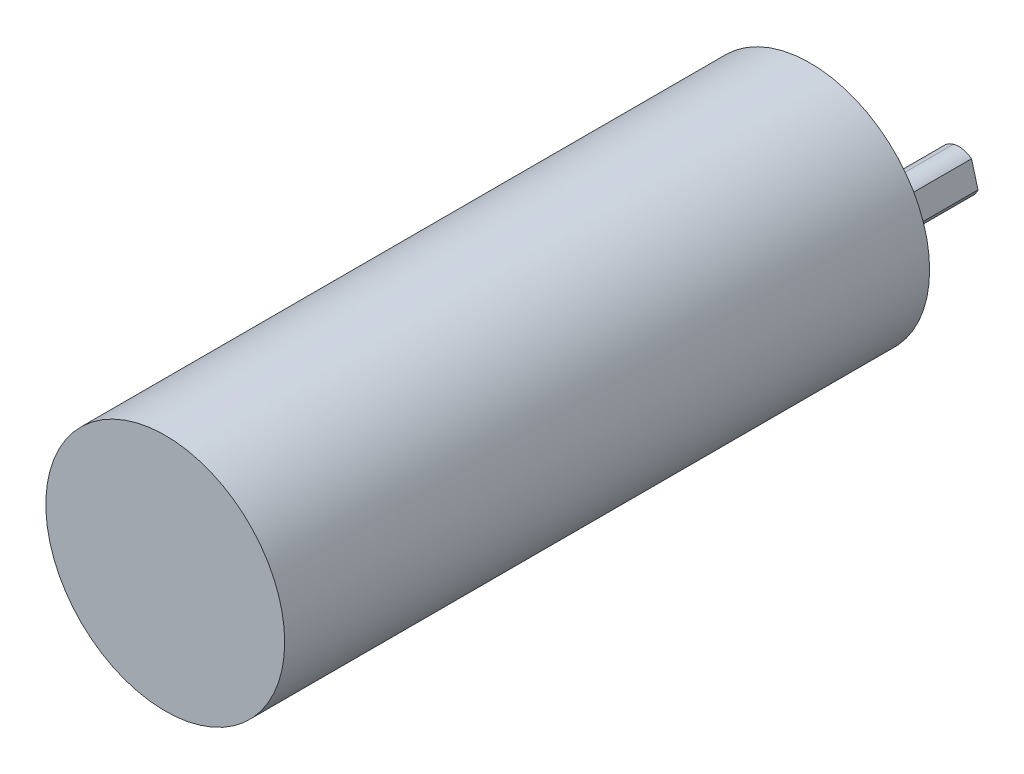
ISO-10303-21;
HEADER;
FILE_DESCRIPTION(('STEP AP214'),'2;1');
FILE_NAME('part.step','',(''),(''),'','','');
FILE_SCHEMA(('AUTOMOTIVE_DESIGN { 1 0 10303 214 1 1 1 1 }'));
ENDSEC;
DATA;
#1=APPLICATION_CONTEXT('core data for automotive mechanical design processes');
#2=APPLICATION_PROTOCOL_DEFINITION('international standard','automotive_design',2000,#1);
#3=PRODUCT_CONTEXT('',#1,'mechanical');
#4=PRODUCT('Part','Part','',(#3));
#5=PRODUCT_RELATED_PRODUCT_CATEGORY('part','',(#4));
#6=PRODUCT_DEFINITION_FORMATION('','',#4);
#7=PRODUCT_DEFINITION_CONTEXT('part definition',#1,'design');
#8=PRODUCT_DEFINITION('design','',#6,#7);
#9=PRODUCT_DEFINITION_SHAPE('','',#8);
#10=(LENGTH_UNIT() NAMED_UNIT(*) SI_UNIT(.MILLI.,.METRE.));
#11=(NAMED_UNIT(*) PLANE_ANGLE_UNIT() SI_UNIT($,.RADIAN.));
#12=(NAMED_UNIT(*) SI_UNIT($,.STERADIAN.) SOLID_ANGLE_UNIT());
#13=UNCERTAINTY_MEASURE_WITH_UNIT(LENGTH_MEASURE(1.E-05),#10,'distance_accuracy_value','');
#14=(GEOMETRIC_REPRESENTATION_CONTEXT(3) GLOBAL_UNCERTAINTY_ASSIGNED_CONTEXT((#13)) GLOBAL_UNIT_ASSIGNED_CONTEXT((#10,
#11,#12)) REPRESENTATION_CONTEXT('',''));
#15=CARTESIAN_POINT('',(0.,0.,0.));
#16=DIRECTION('',(0.,0.,1.));
#17=DIRECTION('',(1.,0.,0.));
#18=AXIS2_PLACEMENT_3D('',#15,#16,#17);
#19=CARTESIAN_POINT('',(4.25509237220179E-10,91.4999999971955,94.5));
#20=DIRECTION('',(0.,0.,-1.));
#21=DIRECTION('',(-1.,0.,0.));
#22=AXIS2_PLACEMENT_3D('',#19,#20,#21);
#23=CYLINDRICAL_SURFACE('',#22,17.4999999971955);
#24=CARTESIAN_POINT('',(4.25509237220179E-10,91.4999999971955,94.5));
#25=DIRECTION('',(0.,0.,1.));
#26=DIRECTION('',(1.,0.,0.));
#27=AXIS2_PLACEMENT_3D('',#24,#25,#26);
#28=CIRCLE('',#27,17.4999999971955);
#29=CARTESIAN_POINT('',(17.499999997621,91.4999999971955,94.5));
#30=VERTEX_POINT('',#29);
#31=EDGE_CURVE('E207',#30,#30,#28,.T.);
#32=ORIENTED_EDGE('',*,*,#31,.F.);
#33=EDGE_LOOP('',(#32));
#34=FACE_BOUND('',#33,.T.);
#35=CARTESIAN_POINT('',(4.25509237220179E-10,91.4999999971955,0.));
#36=DIRECTION('',(0.,0.,1.));
#37=DIRECTION('',(1.,0.,0.));
#38=AXIS2_PLACEMENT_3D('',#35,#36,#37);
#39=CIRCLE('',#38,17.4999999971955);
#40=CARTESIAN_POINT('',(17.499999997621,91.4999999971955,0.));
#41=VERTEX_POINT('',#40);
#42=EDGE_CURVE('E204',#41,#41,#39,.T.);
#43=ORIENTED_EDGE('',*,*,#42,.T.);
#44=EDGE_LOOP('',(#43));
#45=FACE_BOUND('',#44,.T.);
#46=ADVANCED_FACE('F37',(#34,#45),#23,.T.);
#47=CARTESIAN_POINT('',(0.,0.,94.5));
#48=DIRECTION('',(0.,0.,1.));
#49=DIRECTION('',(1.,0.,0.));
#50=AXIS2_PLACEMENT_3D('',#47,#48,#49);
#51=PLANE('',#50);
#52=ORIENTED_EDGE('',*,*,#31,.T.);
#53=EDGE_LOOP('',(#52));
#54=FACE_BOUND('',#53,.T.);
#55=ADVANCED_FACE('F248',(#54),#51,.T.);
#56=CARTESIAN_POINT('',(0.,0.,0.));
#57=DIRECTION('',(0.,0.,1.));
#58=DIRECTION('',(1.,0.,0.));
#59=AXIS2_PLACEMENT_3D('',#56,#57,#58);
#60=PLANE('',#59);
#61=CARTESIAN_POINT('',(4.25517260316255E-10,106.300736889701,0.));
#62=DIRECTION('',(0.,0.,1.));
#63=DIRECTION('',(1.,0.,0.));
#64=AXIS2_PLACEMENT_3D('',#61,#62,#63);
#65=CIRCLE('',#64,1.5);
#66=CARTESIAN_POINT('',(1.50000000042552,106.300736889701,0.));
#67=VERTEX_POINT('',#66);
#68=EDGE_CURVE('E270',#67,#67,#65,.T.);
#69=ORIENTED_EDGE('',*,*,#68,.T.);
#70=EDGE_LOOP('',(#69));
#71=FACE_BOUND('',#70,.T.);
#72=CARTESIAN_POINT('',(-12.8178141432145,84.0996315509425,0.));
#73=DIRECTION('',(0.,0.,1.));
#74=DIRECTION('',(1.,0.,0.));
#75=AXIS2_PLACEMENT_3D('',#72,#73,#74);
#76=CIRCLE('',#75,1.5);
#77=CARTESIAN_POINT('',(-11.3178141432145,84.0996315509425,0.));
#78=VERTEX_POINT('',#77);
#79=EDGE_CURVE('E274',#78,#78,#76,.T.);
#80=ORIENTED_EDGE('',*,*,#79,.T.);
#81=EDGE_LOOP('',(#80));
#82=FACE_BOUND('',#81,.T.);
#83=CARTESIAN_POINT('',(12.8178141440655,84.0996315509425,0.));
#84=DIRECTION('',(0.,0.,1.));
#85=DIRECTION('',(1.,0.,0.));
#86=AXIS2_PLACEMENT_3D('',#83,#84,#85);
#87=CIRCLE('',#86,1.5);
#88=CARTESIAN_POINT('',(14.3178141440655,84.0996315509425,0.));
#89=VERTEX_POINT('',#88);
#90=EDGE_CURVE('E278',#89,#89,#87,.T.);
#91=ORIENTED_EDGE('',*,*,#90,.T.);
#92=EDGE_LOOP('',(#91));
#93=FACE_BOUND('',#92,.T.);
#94=CARTESIAN_POINT('',(-3.24532067885739E-10,84.4999999971955,0.));
#95=DIRECTION('',(0.,0.,1.));
#96=DIRECTION('',(1.,0.,0.));
#97=AXIS2_PLACEMENT_3D('',#94,#95,#96);
#98=CIRCLE('',#97,6.50000000000001);
#99=CARTESIAN_POINT('',(6.49999999967547,84.4999999971955,0.));
#100=VERTEX_POINT('',#99);
#101=EDGE_CURVE('E197',#100,#100,#98,.T.);
#102=ORIENTED_EDGE('',*,*,#101,.T.);
#103=EDGE_LOOP('',(#102));
#104=FACE_BOUND('',#103,.T.);
#105=ORIENTED_EDGE('',*,*,#42,.F.);
#106=EDGE_LOOP('',(#105));
#107=FACE_BOUND('',#106,.T.);
#108=ADVANCED_FACE('F253',(#71,#82,#93,#104,#107),#60,.F.);
#109=CARTESIAN_POINT('',(-3.24532067885739E-10,84.4999999971955,-6.3));
#110=DIRECTION('',(0.,0.,1.));
#111=DIRECTION('',(1.,0.,0.));
#112=AXIS2_PLACEMENT_3D('',#109,#110,#111);
#113=CYLINDRICAL_SURFACE('',#112,6.50000000000001);
#114=ORIENTED_EDGE('',*,*,#101,.F.);
#115=EDGE_LOOP('',(#114));
#116=FACE_BOUND('',#115,.T.);
#117=CARTESIAN_POINT('',(-3.24525128991837E-10,84.4999999971955,-6.3));
#118=DIRECTION('',(0.,0.,1.));
#119=DIRECTION('',(1.,0.,0.));
#120=AXIS2_PLACEMENT_3D('',#117,#118,#119);
#121=CIRCLE('',#120,6.50000000000001);
#122=CARTESIAN_POINT('',(6.49999999967548,84.4999999971955,-6.3));
#123=VERTEX_POINT('',#122);
#124=EDGE_CURVE('E201',#123,#123,#121,.T.);
#125=ORIENTED_EDGE('',*,*,#124,.T.);
#126=EDGE_LOOP('',(#125));
#127=FACE_BOUND('',#126,.T.);
#128=ADVANCED_FACE('F261',(#116,#127),#113,.T.);
#129=CARTESIAN_POINT('',(-3.24525128991837E-10,84.4999999971955,-6.3));
#130=DIRECTION('',(0.,0.,1.));
#131=DIRECTION('',(1.,0.,0.));
#132=AXIS2_PLACEMENT_3D('',#129,#130,#131);
#133=PLANE('',#132);
#134=DIRECTION('',(-0.263005405681324,0.964794359738075,0.));
#135=VECTOR('',#134,1.);
#136=CARTESIAN_POINT('',(2.31550646374497,85.131212971021,-6.3));
#137=LINE('',#136,#135);
#138=CARTESIAN_POINT('',(2.78891619442722,83.3945831218202,-6.3));
#139=VERTEX_POINT('',#138);
#140=CARTESIAN_POINT('',(1.8420967331665,86.8678428198411,-6.3));
#141=VERTEX_POINT('',#140);
#142=EDGE_CURVE('E46',#139,#141,#137,.T.);
#143=ORIENTED_EDGE('',*,*,#142,.T.);
#144=CARTESIAN_POINT('',(1.8420967331665,86.8678428198411,-6.3));
#145=CARTESIAN_POINT('',(1.79568532637606,86.9027319531548,-6.3));
#146=CARTESIAN_POINT('',(1.70301888371369,86.9723926701063,-6.3));
#147=CARTESIAN_POINT('',(1.55672728013267,87.0664038094474,-6.3));
#148=CARTESIAN_POINT('',(1.40561087390279,87.1523143436079,-6.3));
#149=CARTESIAN_POINT('',(1.19763076663687,87.2547944119245,-6.3));
#150=CARTESIAN_POINT('',(0.927054567246304,87.3604002259972,-6.3));
#151=CARTESIAN_POINT('',(0.590008097157471,87.448165440298,-6.3));
#152=CARTESIAN_POINT('',(0.245052476476594,87.496980217615,-6.3));
#153=CARTESIAN_POINT('',(-0.103018763512306,87.5044268687704,-6.3));
#154=CARTESIAN_POINT('',(-0.450475036006126,87.4747174233347,-6.3));
#155=CARTESIAN_POINT('',(-0.676169155140937,87.4211611913778,-6.3));
#156=CARTESIAN_POINT('',(-0.789016214390927,87.3943830754747,-6.3));
#157=B_SPLINE_CURVE_WITH_KNOTS('',3,(#144,#145,#146,#147,#148,#149,#150,#151,#152,#153,#154,
#155,#156),.UNSPECIFIED.,.F.,.F.,(4,1,1,1,1,1,1,1,1,1,4),(0.,0.0626252178864869,
0.125039436720636,0.187453655581398,0.250078873547453,0.375065728490742,0.500052582612676,
0.625039437204412,0.750026291204919,0.875013145954008,1.),.UNSPECIFIED.);
#158=CARTESIAN_POINT('',(-0.789016214390927,87.3943830754747,-6.3));
#159=VERTEX_POINT('',#158);
#160=EDGE_CURVE('E11',#141,#159,#157,.T.);
#161=ORIENTED_EDGE('',*,*,#160,.T.);
#162=CARTESIAN_POINT('',(-0.789016214390927,87.3943830754747,-6.3));
#163=CARTESIAN_POINT('',(-0.836251367332505,87.3807903965287,-6.3));
#164=CARTESIAN_POINT('',(-0.930607605262477,87.3536378635347,-6.3));
#165=CARTESIAN_POINT('',(-1.06933613146334,87.3041888367416,-6.3));
#166=CARTESIAN_POINT('',(-1.20561684551329,87.2484499500035,-6.3));
#167=CARTESIAN_POINT('',(-1.38342522125445,87.1651150037334,-6.3));
#168=CARTESIAN_POINT('',(-1.59785628813684,87.0448377020313,-6.3));
#169=CARTESIAN_POINT('',(-1.91983775112844,86.8198243428078,-6.3));
#170=CARTESIAN_POINT('',(-2.27874207295563,86.4808979331184,-6.3));
#171=CARTESIAN_POINT('',(-2.62132698704681,85.9983230847996,-6.3));
#172=CARTESIAN_POINT('',(-2.86328969619378,85.4581248201418,-6.3));
#173=CARTESIAN_POINT('',(-2.99518724092974,84.8811180655355,-6.3));
#174=CARTESIAN_POINT('',(-3.01198965056183,84.2894620058242,-6.3));
#175=CARTESIAN_POINT('',(-2.91304063678149,83.705897706485,-6.3));
#176=CARTESIAN_POINT('',(-2.70214626597646,83.1528498516172,-6.3));
#177=CARTESIAN_POINT('',(-2.38740764533848,82.6515731601984,-6.3));
#178=CARTESIAN_POINT('',(-1.98093025506326,82.2213271851291,-6.3));
#179=CARTESIAN_POINT('',(-1.49829725970673,81.8786615315902,-6.3));
#180=CARTESIAN_POINT('',(-0.958195813920655,81.6366869524099,-6.3));
#181=CARTESIAN_POINT('',(-0.476965961735374,81.5268525907159,-6.3));
#182=CARTESIAN_POINT('',(-0.0852853333728205,81.4962438346301,-6.3));
#183=CARTESIAN_POINT('',(0.209437390089825,81.5028533306871,-6.3));
#184=CARTESIAN_POINT('',(0.502671967144643,81.5361563290898,-6.3));
#185=CARTESIAN_POINT('',(0.693568134876839,81.5824633896139,-6.3));
#186=CARTESIAN_POINT('',(0.78901621891425,81.6056169199174,-6.3));
#187=B_SPLINE_CURVE_WITH_KNOTS('',3,(#162,#163,#164,#165,#166,#167,#168,#169,#170,#171,#172,
#173,#174,#175,#176,#177,#178,#179,#180,#181,#182,#183,#184,#185,#186),.UNSPECIFIED.,.F.,.F.,(4,
1,1,1,1,1,1,1,1,1,1,1,1,1,1,1,1,1,1,1,1,1,4),(0.,0.0156625307418573,0.0312872381103852,
0.0469119454508162,0.0625744761085863,0.0938522797716338,0.125130083392159,0.187609975293387,
0.250089866910196,0.31256975895445,0.375049650747091,0.437529542574312,0.50000943439632,
0.562489326218328,0.624969218045549,0.68744910983819,0.749929001882444,0.812408893499253,
0.874888785400481,0.906166589021006,0.937444392684054,0.968722196285884,1.),.UNSPECIFIED.);
#188=CARTESIAN_POINT('',(0.78901621891425,81.6056169199174,-6.3));
#189=VERTEX_POINT('',#188);
#190=EDGE_CURVE('E81',#159,#189,#187,.T.);
#191=ORIENTED_EDGE('',*,*,#190,.T.);
#192=CARTESIAN_POINT('',(0.78901621891425,81.6056169199174,-6.3));
#193=CARTESIAN_POINT('',(0.844774369664732,81.6218125651894,-6.3));
#194=CARTESIAN_POINT('',(0.956102809021713,81.6541492888475,-6.3));
#195=CARTESIAN_POINT('',(1.11908668339583,81.7147758872048,-6.3));
#196=CARTESIAN_POINT('',(1.27848495556866,81.7841226910104,-6.3));
#197=CARTESIAN_POINT('',(1.48525707650366,81.8890187318419,-6.3));
#198=CARTESIAN_POINT('',(1.73208744254224,82.0421162109171,-6.3));
#199=CARTESIAN_POINT('',(2.0045274973912,82.259094254312,-6.3));
#200=CARTESIAN_POINT('',(2.25055269522548,82.5057698829792,-6.3));
#201=CARTESIAN_POINT('',(2.4653527521833,82.7797588900301,-6.3));
#202=CARTESIAN_POINT('',(2.6500589655469,83.0755495711938,-6.3));
#203=CARTESIAN_POINT('',(2.74263045148024,83.2882386049748,-6.3));
#204=CARTESIAN_POINT('',(2.78891619442722,83.3945831218202,-6.3));
#205=B_SPLINE_CURVE_WITH_KNOTS('',3,(#192,#193,#194,#195,#196,#197,#198,#199,#200,#201,#202,
#203,#204),.UNSPECIFIED.,.F.,.F.,(4,1,1,1,1,1,1,1,1,1,4),(0.,0.0626252178644416,
0.125039436842877,0.187453655997311,0.250078874387967,0.375065728389572,0.500052582982408,
0.625039437105441,0.750026292049829,0.875013146078072,1.),.UNSPECIFIED.);
#206=EDGE_CURVE('E215',#189,#139,#205,.T.);
#207=ORIENTED_EDGE('',*,*,#206,.T.);
#208=EDGE_LOOP('',(#143,#161,#191,#207));
#209=FACE_BOUND('',#208,.T.);
#210=ORIENTED_EDGE('',*,*,#124,.F.);
#211=EDGE_LOOP('',(#210));
#212=FACE_BOUND('',#211,.T.);
#213=ADVANCED_FACE('F121',(#209,#212),#133,.F.);
#214=CARTESIAN_POINT('',(1.8420967331665,86.8678428198411,-21.8));
#215=CARTESIAN_POINT('',(1.79568532637606,86.9027319531548,-21.8));
#216=CARTESIAN_POINT('',(1.70301888371369,86.9723926701063,-21.8));
#217=CARTESIAN_POINT('',(1.55672728013267,87.0664038094474,-21.8));
#218=CARTESIAN_POINT('',(1.40561087390279,87.1523143436079,-21.8));
#219=CARTESIAN_POINT('',(1.19763076663687,87.2547944119245,-21.8));
#220=CARTESIAN_POINT('',(0.927054567246304,87.3604002259972,-21.8));
#221=CARTESIAN_POINT('',(0.590008097157471,87.448165440298,-21.8));
#222=CARTESIAN_POINT('',(0.245052476476594,87.496980217615,-21.8));
#223=CARTESIAN_POINT('',(-0.103018763512306,87.5044268687704,-21.8));
#224=CARTESIAN_POINT('',(-0.450475036006126,87.4747174233347,-21.8));
#225=CARTESIAN_POINT('',(-0.676169155140937,87.4211611913778,-21.8));
#226=CARTESIAN_POINT('',(-0.789016214390927,87.3943830754747,-21.8));
#227=B_SPLINE_CURVE_WITH_KNOTS('',3,(#214,#215,#216,#217,#218,#219,#220,#221,#222,#223,#224,
#225,#226),.UNSPECIFIED.,.F.,.F.,(4,1,1,1,1,1,1,1,1,1,4),(0.,0.0626252178864869,
0.125039436720636,0.187453655581398,0.250078873547453,0.375065728490742,0.500052582612676,
0.625039437204412,0.750026291204919,0.875013145954008,1.),.UNSPECIFIED.);
#228=DIRECTION('',(0.,0.,1.));
#229=VECTOR('',#228,1.);
#230=SURFACE_OF_LINEAR_EXTRUSION('',#227,#229);
#231=ORIENTED_EDGE('',*,*,#160,.F.);
#232=DIRECTION('',(0.,0.,1.));
#233=VECTOR('',#232,1.);
#234=CARTESIAN_POINT('',(1.8420967331665,86.8678428198411,-21.8));
#235=LINE('',#234,#233);
#236=CARTESIAN_POINT('',(1.8420967331665,86.8678428198411,-21.8));
#237=VERTEX_POINT('',#236);
#238=EDGE_CURVE('E101',#237,#141,#235,.T.);
#239=ORIENTED_EDGE('',*,*,#238,.F.);
#240=CARTESIAN_POINT('',(1.8420967331665,86.8678428198411,-21.8));
#241=CARTESIAN_POINT('',(1.79568532637606,86.9027319531548,-21.8));
#242=CARTESIAN_POINT('',(1.70301888371369,86.9723926701063,-21.8));
#243=CARTESIAN_POINT('',(1.55672728013267,87.0664038094474,-21.8));
#244=CARTESIAN_POINT('',(1.40561087390279,87.1523143436079,-21.8));
#245=CARTESIAN_POINT('',(1.19763076663687,87.2547944119245,-21.8));
#246=CARTESIAN_POINT('',(0.927054567246304,87.3604002259972,-21.8));
#247=CARTESIAN_POINT('',(0.590008097157471,87.448165440298,-21.8));
#248=CARTESIAN_POINT('',(0.245052476476594,87.496980217615,-21.8));
#249=CARTESIAN_POINT('',(-0.103018763512306,87.5044268687704,-21.8));
#250=CARTESIAN_POINT('',(-0.450475036006126,87.4747174233347,-21.8));
#251=CARTESIAN_POINT('',(-0.676169155140937,87.4211611913778,-21.8));
#252=CARTESIAN_POINT('',(-0.789016214390927,87.3943830754747,-21.8));
#253=B_SPLINE_CURVE_WITH_KNOTS('',3,(#240,#241,#242,#243,#244,#245,#246,#247,#248,#249,#250,
#251,#252),.UNSPECIFIED.,.F.,.F.,(4,1,1,1,1,1,1,1,1,1,4),(0.,0.0626252178864869,
0.125039436720636,0.187453655581398,0.250078873547453,0.375065728490742,0.500052582612676,
0.625039437204412,0.750026291204919,0.875013145954008,1.),.UNSPECIFIED.);
#254=CARTESIAN_POINT('',(-0.789016214390927,87.3943830754747,-21.8));
#255=VERTEX_POINT('',#254);
#256=EDGE_CURVE('E91',#237,#255,#253,.T.);
#257=ORIENTED_EDGE('',*,*,#256,.T.);
#258=DIRECTION('',(0.,0.,1.));
#259=VECTOR('',#258,1.);
#260=CARTESIAN_POINT('',(-0.789016214390927,87.3943830754747,-21.8));
#261=LINE('',#260,#259);
#262=EDGE_CURVE('E75',#255,#159,#261,.T.);
#263=ORIENTED_EDGE('',*,*,#262,.T.);
#264=EDGE_LOOP('',(#231,#239,#257,#263));
#265=FACE_BOUND('',#264,.T.);
#266=ADVANCED_FACE('F100',(#265),#230,.T.);
#267=CARTESIAN_POINT('',(2.78891619442722,83.3945831218202,-21.8));
#268=DIRECTION('',(0.964794359738075,0.263005405681324,0.));
#269=DIRECTION('',(-0.263005405681324,0.964794359738075,0.));
#270=AXIS2_PLACEMENT_3D('',#267,#268,#269);
#271=PLANE('',#270);
#272=ORIENTED_EDGE('',*,*,#142,.F.);
#273=DIRECTION('',(0.,0.,1.));
#274=VECTOR('',#273,1.);
#275=CARTESIAN_POINT('',(2.78891619442722,83.3945831218202,-21.8));
#276=LINE('',#275,#274);
#277=CARTESIAN_POINT('',(2.78891619442722,83.3945831218202,-21.8));
#278=VERTEX_POINT('',#277);
#279=EDGE_CURVE('E198',#278,#139,#276,.T.);
#280=ORIENTED_EDGE('',*,*,#279,.F.);
#281=DIRECTION('',(-0.263005405681324,0.964794359738075,0.));
#282=VECTOR('',#281,1.);
#283=CARTESIAN_POINT('',(2.78891619442722,83.3945831218202,-21.8));
#284=LINE('',#283,#282);
#285=EDGE_CURVE('E83',#278,#237,#284,.T.);
#286=ORIENTED_EDGE('',*,*,#285,.T.);
#287=ORIENTED_EDGE('',*,*,#238,.T.);
#288=EDGE_LOOP('',(#272,#280,#286,#287));
#289=FACE_BOUND('',#288,.T.);
#290=ADVANCED_FACE('F120',(#289),#271,.T.);
#291=CARTESIAN_POINT('',(0.78901621891425,81.6056169199174,-21.8));
#292=CARTESIAN_POINT('',(0.844774369664732,81.6218125651894,-21.8));
#293=CARTESIAN_POINT('',(0.956102809021713,81.6541492888475,-21.8));
#294=CARTESIAN_POINT('',(1.11908668339583,81.7147758872048,-21.8));
#295=CARTESIAN_POINT('',(1.27848495556866,81.7841226910104,-21.8));
#296=CARTESIAN_POINT('',(1.48525707650366,81.8890187318419,-21.8));
#297=CARTESIAN_POINT('',(1.73208744254224,82.0421162109171,-21.8));
#298=CARTESIAN_POINT('',(2.0045274973912,82.259094254312,-21.8));
#299=CARTESIAN_POINT('',(2.25055269522548,82.5057698829792,-21.8));
#300=CARTESIAN_POINT('',(2.4653527521833,82.7797588900301,-21.8));
#301=CARTESIAN_POINT('',(2.6500589655469,83.0755495711938,-21.8));
#302=CARTESIAN_POINT('',(2.74263045148024,83.2882386049748,-21.8));
#303=CARTESIAN_POINT('',(2.78891619442722,83.3945831218202,-21.8));
#304=B_SPLINE_CURVE_WITH_KNOTS('',3,(#291,#292,#293,#294,#295,#296,#297,#298,#299,#300,#301,
#302,#303),.UNSPECIFIED.,.F.,.F.,(4,1,1,1,1,1,1,1,1,1,4),(0.,0.0626252178644416,
0.125039436842877,0.187453655997311,0.250078874387967,0.375065728389572,0.500052582982408,
0.625039437105441,0.750026292049829,0.875013146078072,1.),.UNSPECIFIED.);
#305=DIRECTION('',(0.,0.,1.));
#306=VECTOR('',#305,1.);
#307=SURFACE_OF_LINEAR_EXTRUSION('',#304,#306);
#308=ORIENTED_EDGE('',*,*,#206,.F.);
#309=DIRECTION('',(0.,0.,1.));
#310=VECTOR('',#309,1.);
#311=CARTESIAN_POINT('',(0.78901621891425,81.6056169199174,-21.8));
#312=LINE('',#311,#310);
#313=CARTESIAN_POINT('',(0.78901621891425,81.6056169199174,-21.8));
#314=VERTEX_POINT('',#313);
#315=EDGE_CURVE('E53',#314,#189,#312,.T.);
#316=ORIENTED_EDGE('',*,*,#315,.F.);
#317=CARTESIAN_POINT('',(0.78901621891425,81.6056169199174,-21.8));
#318=CARTESIAN_POINT('',(0.844774369664732,81.6218125651894,-21.8));
#319=CARTESIAN_POINT('',(0.956102809021713,81.6541492888475,-21.8));
#320=CARTESIAN_POINT('',(1.11908668339583,81.7147758872048,-21.8));
#321=CARTESIAN_POINT('',(1.27848495556866,81.7841226910104,-21.8));
#322=CARTESIAN_POINT('',(1.48525707650366,81.8890187318419,-21.8));
#323=CARTESIAN_POINT('',(1.73208744254224,82.0421162109171,-21.8));
#324=CARTESIAN_POINT('',(2.0045274973912,82.259094254312,-21.8));
#325=CARTESIAN_POINT('',(2.25055269522548,82.5057698829792,-21.8));
#326=CARTESIAN_POINT('',(2.4653527521833,82.7797588900301,-21.8));
#327=CARTESIAN_POINT('',(2.6500589655469,83.0755495711938,-21.8));
#328=CARTESIAN_POINT('',(2.74263045148024,83.2882386049748,-21.8));
#329=CARTESIAN_POINT('',(2.78891619442722,83.3945831218202,-21.8));
#330=B_SPLINE_CURVE_WITH_KNOTS('',3,(#317,#318,#319,#320,#321,#322,#323,#324,#325,#326,#327,
#328,#329),.UNSPECIFIED.,.F.,.F.,(4,1,1,1,1,1,1,1,1,1,4),(0.,0.0626252178644416,
0.125039436842877,0.187453655997311,0.250078874387967,0.375065728389572,0.500052582982408,
0.625039437105441,0.750026292049829,0.875013146078072,1.),.UNSPECIFIED.);
#331=EDGE_CURVE('E95',#314,#278,#330,.T.);
#332=ORIENTED_EDGE('',*,*,#331,.T.);
#333=ORIENTED_EDGE('',*,*,#279,.T.);
#334=EDGE_LOOP('',(#308,#316,#332,#333));
#335=FACE_BOUND('',#334,.T.);
#336=ADVANCED_FACE('F150',(#335),#307,.T.);
#337=CARTESIAN_POINT('',(-0.789016214390927,87.3943830754747,-21.8));
#338=CARTESIAN_POINT('',(-0.836251367332505,87.3807903965287,-21.8));
#339=CARTESIAN_POINT('',(-0.930607605262477,87.3536378635347,-21.8));
#340=CARTESIAN_POINT('',(-1.06933613146334,87.3041888367416,-21.8));
#341=CARTESIAN_POINT('',(-1.20561684551329,87.2484499500035,-21.8));
#342=CARTESIAN_POINT('',(-1.38342522125445,87.1651150037334,-21.8));
#343=CARTESIAN_POINT('',(-1.59785628813684,87.0448377020313,-21.8));
#344=CARTESIAN_POINT('',(-1.91983775112844,86.8198243428078,-21.8));
#345=CARTESIAN_POINT('',(-2.27874207295563,86.4808979331184,-21.8));
#346=CARTESIAN_POINT('',(-2.62132698704681,85.9983230847996,-21.8));
#347=CARTESIAN_POINT('',(-2.86328969619378,85.4581248201418,-21.8));
#348=CARTESIAN_POINT('',(-2.99518724092974,84.8811180655355,-21.8));
#349=CARTESIAN_POINT('',(-3.01198965056183,84.2894620058242,-21.8));
#350=CARTESIAN_POINT('',(-2.91304063678149,83.705897706485,-21.8));
#351=CARTESIAN_POINT('',(-2.70214626597646,83.1528498516172,-21.8));
#352=CARTESIAN_POINT('',(-2.38740764533848,82.6515731601984,-21.8));
#353=CARTESIAN_POINT('',(-1.98093025506326,82.2213271851291,-21.8));
#354=CARTESIAN_POINT('',(-1.49829725970673,81.8786615315902,-21.8));
#355=CARTESIAN_POINT('',(-0.958195813920655,81.6366869524099,-21.8));
#356=CARTESIAN_POINT('',(-0.476965961735374,81.5268525907159,-21.8));
#357=CARTESIAN_POINT('',(-0.0852853333728205,81.4962438346301,-21.8));
#358=CARTESIAN_POINT('',(0.209437390089825,81.5028533306871,-21.8));
#359=CARTESIAN_POINT('',(0.502671967144643,81.5361563290898,-21.8));
#360=CARTESIAN_POINT('',(0.693568134876839,81.5824633896139,-21.8));
#361=CARTESIAN_POINT('',(0.78901621891425,81.6056169199174,-21.8));
#362=B_SPLINE_CURVE_WITH_KNOTS('',3,(#337,#338,#339,#340,#341,#342,#343,#344,#345,#346,#347,
#348,#349,#350,#351,#352,#353,#354,#355,#356,#357,#358,#359,#360,#361),.UNSPECIFIED.,.F.,.F.,(4,
1,1,1,1,1,1,1,1,1,1,1,1,1,1,1,1,1,1,1,1,1,4),(0.,0.0156625307418573,0.0312872381103852,
0.0469119454508162,0.0625744761085863,0.0938522797716338,0.125130083392159,0.187609975293387,
0.250089866910196,0.31256975895445,0.375049650747091,0.437529542574312,0.50000943439632,
0.562489326218328,0.624969218045549,0.68744910983819,0.749929001882444,0.812408893499253,
0.874888785400481,0.906166589021006,0.937444392684054,0.968722196285884,1.),.UNSPECIFIED.);
#363=DIRECTION('',(0.,0.,1.));
#364=VECTOR('',#363,1.);
#365=SURFACE_OF_LINEAR_EXTRUSION('',#362,#364);
#366=ORIENTED_EDGE('',*,*,#190,.F.);
#367=ORIENTED_EDGE('',*,*,#262,.F.);
#368=CARTESIAN_POINT('',(-0.789016214390927,87.3943830754747,-21.8));
#369=CARTESIAN_POINT('',(-0.836251367332505,87.3807903965287,-21.8));
#370=CARTESIAN_POINT('',(-0.930607605262477,87.3536378635347,-21.8));
#371=CARTESIAN_POINT('',(-1.06933613146334,87.3041888367416,-21.8));
#372=CARTESIAN_POINT('',(-1.20561684551329,87.2484499500035,-21.8));
#373=CARTESIAN_POINT('',(-1.38342522125445,87.1651150037334,-21.8));
#374=CARTESIAN_POINT('',(-1.59785628813684,87.0448377020313,-21.8));
#375=CARTESIAN_POINT('',(-1.91983775112844,86.8198243428078,-21.8));
#376=CARTESIAN_POINT('',(-2.27874207295563,86.4808979331184,-21.8));
#377=CARTESIAN_POINT('',(-2.62132698704681,85.9983230847996,-21.8));
#378=CARTESIAN_POINT('',(-2.86328969619378,85.4581248201418,-21.8));
#379=CARTESIAN_POINT('',(-2.99518724092974,84.8811180655355,-21.8));
#380=CARTESIAN_POINT('',(-3.01198965056183,84.2894620058242,-21.8));
#381=CARTESIAN_POINT('',(-2.91304063678149,83.705897706485,-21.8));
#382=CARTESIAN_POINT('',(-2.70214626597646,83.1528498516172,-21.8));
#383=CARTESIAN_POINT('',(-2.38740764533848,82.6515731601984,-21.8));
#384=CARTESIAN_POINT('',(-1.98093025506326,82.2213271851291,-21.8));
#385=CARTESIAN_POINT('',(-1.49829725970673,81.8786615315902,-21.8));
#386=CARTESIAN_POINT('',(-0.958195813920655,81.6366869524099,-21.8));
#387=CARTESIAN_POINT('',(-0.476965961735374,81.5268525907159,-21.8));
#388=CARTESIAN_POINT('',(-0.0852853333728205,81.4962438346301,-21.8));
#389=CARTESIAN_POINT('',(0.209437390089825,81.5028533306871,-21.8));
#390=CARTESIAN_POINT('',(0.502671967144643,81.5361563290898,-21.8));
#391=CARTESIAN_POINT('',(0.693568134876839,81.5824633896139,-21.8));
#392=CARTESIAN_POINT('',(0.78901621891425,81.6056169199174,-21.8));
#393=B_SPLINE_CURVE_WITH_KNOTS('',3,(#368,#369,#370,#371,#372,#373,#374,#375,#376,#377,#378,
#379,#380,#381,#382,#383,#384,#385,#386,#387,#388,#389,#390,#391,#392),.UNSPECIFIED.,.F.,.F.,(4,
1,1,1,1,1,1,1,1,1,1,1,1,1,1,1,1,1,1,1,1,1,4),(0.,0.0156625307418573,0.0312872381103852,
0.0469119454508162,0.0625744761085863,0.0938522797716338,0.125130083392159,0.187609975293387,
0.250089866910196,0.31256975895445,0.375049650747091,0.437529542574312,0.50000943439632,
0.562489326218328,0.624969218045549,0.68744910983819,0.749929001882444,0.812408893499253,
0.874888785400481,0.906166589021006,0.937444392684054,0.968722196285884,1.),.UNSPECIFIED.);
#394=EDGE_CURVE('E78',#255,#314,#393,.T.);
#395=ORIENTED_EDGE('',*,*,#394,.T.);
#396=ORIENTED_EDGE('',*,*,#315,.T.);
#397=EDGE_LOOP('',(#366,#367,#395,#396));
#398=FACE_BOUND('',#397,.T.);
#399=ADVANCED_FACE('F77',(#398),#365,.T.);
#400=CARTESIAN_POINT('',(0.588833365871073,87.4416449673462,-21.8));
#401=DIRECTION('',(0.,0.,-1.));
#402=DIRECTION('',(-1.,0.,0.));
#403=AXIS2_PLACEMENT_3D('',#400,#401,#402);
#404=PLANE('',#403);
#405=ORIENTED_EDGE('',*,*,#256,.F.);
#406=ORIENTED_EDGE('',*,*,#285,.F.);
#407=ORIENTED_EDGE('',*,*,#331,.F.);
#408=ORIENTED_EDGE('',*,*,#394,.F.);
#409=EDGE_LOOP('',(#405,#406,#407,#408));
#410=FACE_BOUND('',#409,.T.);
#411=ADVANCED_FACE('F89',(#410),#404,.T.);
#412=CARTESIAN_POINT('',(12.8178141440655,84.0996315509425,10.));
#413=DIRECTION('',(0.,0.,-1.));
#414=DIRECTION('',(-1.,0.,0.));
#415=AXIS2_PLACEMENT_3D('',#412,#413,#414);
#416=CYLINDRICAL_SURFACE('',#415,1.5);
#417=CARTESIAN_POINT('',(12.8178141440655,84.0996315509425,10.));
#418=DIRECTION('',(0.,0.,1.));
#419=DIRECTION('',(1.,0.,0.));
#420=AXIS2_PLACEMENT_3D('',#417,#418,#419);
#421=CIRCLE('',#420,1.5);
#422=CARTESIAN_POINT('',(14.3178141440655,84.0996315509425,10.));
#423=VERTEX_POINT('',#422);
#424=EDGE_CURVE('E130',#423,#423,#421,.T.);
#425=ORIENTED_EDGE('',*,*,#424,.T.);
#426=EDGE_LOOP('',(#425));
#427=FACE_BOUND('',#426,.T.);
#428=ORIENTED_EDGE('',*,*,#90,.F.);
#429=EDGE_LOOP('',(#428));
#430=FACE_BOUND('',#429,.T.);
#431=ADVANCED_FACE('F176',(#427,#430),#416,.F.);
#432=CARTESIAN_POINT('',(12.8178141440655,84.0996315509425,10.));
#433=DIRECTION('',(0.,0.,1.));
#434=DIRECTION('',(1.,0.,0.));
#435=AXIS2_PLACEMENT_3D('',#432,#433,#434);
#436=PLANE('',#435);
#437=ORIENTED_EDGE('',*,*,#424,.F.);
#438=EDGE_LOOP('',(#437));
#439=FACE_BOUND('',#438,.T.);
#440=ADVANCED_FACE('F177',(#439),#436,.F.);
#441=CARTESIAN_POINT('',(-12.8178141432145,84.0996315509425,10.));
#442=DIRECTION('',(0.,0.,-1.));
#443=DIRECTION('',(-1.,0.,0.));
#444=AXIS2_PLACEMENT_3D('',#441,#442,#443);
#445=CYLINDRICAL_SURFACE('',#444,1.5);
#446=CARTESIAN_POINT('',(-12.8178141432145,84.0996315509425,10.));
#447=DIRECTION('',(0.,0.,1.));
#448=DIRECTION('',(1.,0.,0.));
#449=AXIS2_PLACEMENT_3D('',#446,#447,#448);
#450=CIRCLE('',#449,1.5);
#451=CARTESIAN_POINT('',(-11.3178141432145,84.0996315509425,10.));
#452=VERTEX_POINT('',#451);
#453=EDGE_CURVE('E438',#452,#452,#450,.T.);
#454=ORIENTED_EDGE('',*,*,#453,.T.);
#455=EDGE_LOOP('',(#454));
#456=FACE_BOUND('',#455,.T.);
#457=ORIENTED_EDGE('',*,*,#79,.F.);
#458=EDGE_LOOP('',(#457));
#459=FACE_BOUND('',#458,.T.);
#460=ADVANCED_FACE('F344',(#456,#459),#445,.F.);
#461=CARTESIAN_POINT('',(-12.8178141432145,84.0996315509425,10.));
#462=DIRECTION('',(0.,0.,1.));
#463=DIRECTION('',(1.,0.,0.));
#464=AXIS2_PLACEMENT_3D('',#461,#462,#463);
#465=PLANE('',#464);
#466=ORIENTED_EDGE('',*,*,#453,.F.);
#467=EDGE_LOOP('',(#466));
#468=FACE_BOUND('',#467,.T.);
#469=ADVANCED_FACE('F354',(#468),#465,.F.);
#470=CARTESIAN_POINT('',(4.25517260316255E-10,106.300736889701,10.));
#471=DIRECTION('',(0.,0.,-1.));
#472=DIRECTION('',(-1.,0.,0.));
#473=AXIS2_PLACEMENT_3D('',#470,#471,#472);
#474=CYLINDRICAL_SURFACE('',#473,1.5);
#475=CARTESIAN_POINT('',(4.25517260316255E-10,106.300736889701,10.));
#476=DIRECTION('',(0.,0.,1.));
#477=DIRECTION('',(1.,0.,0.));
#478=AXIS2_PLACEMENT_3D('',#475,#476,#477);
#479=CIRCLE('',#478,1.5);
#480=CARTESIAN_POINT('',(1.50000000042552,106.300736889701,10.));
#481=VERTEX_POINT('',#480);
#482=EDGE_CURVE('E102',#481,#481,#479,.T.);
#483=ORIENTED_EDGE('',*,*,#482,.T.);
#484=EDGE_LOOP('',(#483));
#485=FACE_BOUND('',#484,.T.);
#486=ORIENTED_EDGE('',*,*,#68,.F.);
#487=EDGE_LOOP('',(#486));
#488=FACE_BOUND('',#487,.T.);
#489=ADVANCED_FACE('F365',(#485,#488),#474,.F.);
#490=CARTESIAN_POINT('',(4.25517260316255E-10,106.300736889701,10.));
#491=DIRECTION('',(0.,0.,1.));
#492=DIRECTION('',(1.,0.,0.));
#493=AXIS2_PLACEMENT_3D('',#490,#491,#492);
#494=PLANE('',#493);
#495=ORIENTED_EDGE('',*,*,#482,.F.);
#496=EDGE_LOOP('',(#495));
#497=FACE_BOUND('',#496,.T.);
#498=ADVANCED_FACE('F376',(#497),#494,.F.);
#499=CLOSED_SHELL('',(#46,#55,#108,#128,#213,#266,#290,#336,#399,#411,#431,#440,#460,#469,#489,#498));
#500=MANIFOLD_SOLID_BREP('B2',#499);
#501=ADVANCED_BREP_SHAPE_REPRESENTATION('',(#18,#500),#14);
#502=SHAPE_DEFINITION_REPRESENTATION(#9,#501);
ENDSEC;
END-ISO-10303-21;
